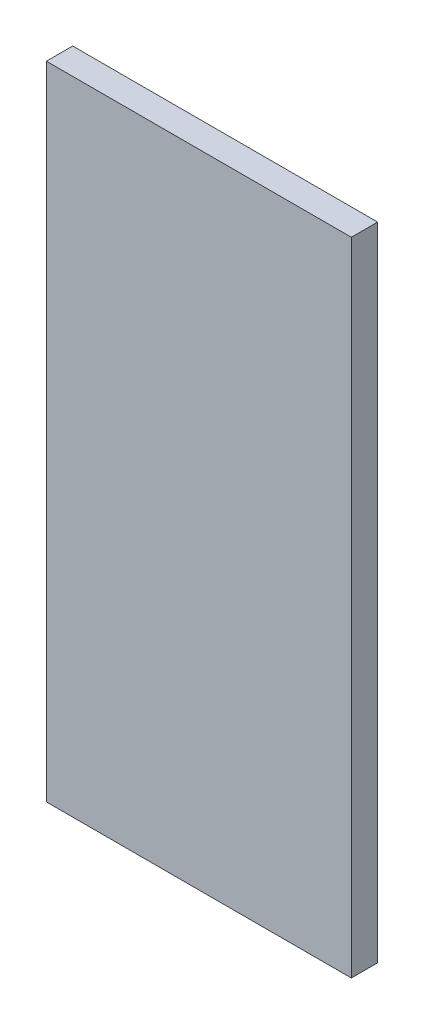
ISO-10303-21;
HEADER;
FILE_DESCRIPTION(('STEP AP214'),'2;1');
FILE_NAME('part.step','',(''),(''),'','','');
FILE_SCHEMA(('AUTOMOTIVE_DESIGN { 1 0 10303 214 1 1 1 1 }'));
ENDSEC;
DATA;
#1=APPLICATION_CONTEXT('core data for automotive mechanical design processes');
#2=APPLICATION_PROTOCOL_DEFINITION('international standard','automotive_design',2000,#1);
#3=PRODUCT_CONTEXT('',#1,'mechanical');
#4=PRODUCT('Part','Part','',(#3));
#5=PRODUCT_RELATED_PRODUCT_CATEGORY('part','',(#4));
#6=PRODUCT_DEFINITION_FORMATION('','',#4);
#7=PRODUCT_DEFINITION_CONTEXT('part definition',#1,'design');
#8=PRODUCT_DEFINITION('design','',#6,#7);
#9=PRODUCT_DEFINITION_SHAPE('','',#8);
#10=(LENGTH_UNIT() NAMED_UNIT(*) SI_UNIT(.MILLI.,.METRE.));
#11=(NAMED_UNIT(*) PLANE_ANGLE_UNIT() SI_UNIT($,.RADIAN.));
#12=(NAMED_UNIT(*) SI_UNIT($,.STERADIAN.) SOLID_ANGLE_UNIT());
#13=UNCERTAINTY_MEASURE_WITH_UNIT(LENGTH_MEASURE(1.E-05),#10,'distance_accuracy_value','');
#14=(GEOMETRIC_REPRESENTATION_CONTEXT(3) GLOBAL_UNCERTAINTY_ASSIGNED_CONTEXT((#13)) GLOBAL_UNIT_ASSIGNED_CONTEXT((#10,
#11,#12)) REPRESENTATION_CONTEXT('',''));
#15=CARTESIAN_POINT('',(0.,0.,0.));
#16=DIRECTION('',(0.,0.,1.));
#17=DIRECTION('',(1.,0.,0.));
#18=AXIS2_PLACEMENT_3D('',#15,#16,#17);
#19=CARTESIAN_POINT('',(145.,-305.,25.));
#20=DIRECTION('',(-1.,0.,0.));
#21=DIRECTION('',(0.,0.,1.));
#22=AXIS2_PLACEMENT_3D('',#19,#20,#21);
#23=PLANE('',#22);
#24=DIRECTION('',(0.,1.,0.));
#25=VECTOR('',#24,1.);
#26=CARTESIAN_POINT('',(145.,-305.,0.));
#27=LINE('',#26,#25);
#28=CARTESIAN_POINT('',(145.,-305.,0.));
#29=VERTEX_POINT('',#28);
#30=CARTESIAN_POINT('',(145.,305.,0.));
#31=VERTEX_POINT('',#30);
#32=EDGE_CURVE('E99',#29,#31,#27,.T.);
#33=ORIENTED_EDGE('',*,*,#32,.T.);
#34=DIRECTION('',(0.,0.,-1.));
#35=VECTOR('',#34,1.);
#36=CARTESIAN_POINT('',(145.,305.,25.));
#37=LINE('',#36,#35);
#38=CARTESIAN_POINT('',(145.,305.,25.));
#39=VERTEX_POINT('',#38);
#40=EDGE_CURVE('E11',#39,#31,#37,.T.);
#41=ORIENTED_EDGE('',*,*,#40,.F.);
#42=DIRECTION('',(0.,1.,0.));
#43=VECTOR('',#42,1.);
#44=CARTESIAN_POINT('',(145.,-305.,25.));
#45=LINE('',#44,#43);
#46=CARTESIAN_POINT('',(145.,-305.,25.));
#47=VERTEX_POINT('',#46);
#48=EDGE_CURVE('E87',#47,#39,#45,.T.);
#49=ORIENTED_EDGE('',*,*,#48,.F.);
#50=DIRECTION('',(0.,0.,-1.));
#51=VECTOR('',#50,1.);
#52=CARTESIAN_POINT('',(145.,-305.,25.));
#53=LINE('',#52,#51);
#54=EDGE_CURVE('E95',#47,#29,#53,.T.);
#55=ORIENTED_EDGE('',*,*,#54,.T.);
#56=EDGE_LOOP('',(#33,#41,#49,#55));
#57=FACE_BOUND('',#56,.T.);
#58=ADVANCED_FACE('F36',(#57),#23,.F.);
#59=CARTESIAN_POINT('',(-145.,305.,25.));
#60=DIRECTION('',(0.,-1.,0.));
#61=DIRECTION('',(0.,0.,-1.));
#62=AXIS2_PLACEMENT_3D('',#59,#60,#61);
#63=PLANE('',#62);
#64=DIRECTION('',(-1.,0.,0.));
#65=VECTOR('',#64,1.);
#66=CARTESIAN_POINT('',(-145.,305.,0.));
#67=LINE('',#66,#65);
#68=CARTESIAN_POINT('',(-145.,305.,0.));
#69=VERTEX_POINT('',#68);
#70=EDGE_CURVE('E91',#31,#69,#67,.T.);
#71=ORIENTED_EDGE('',*,*,#70,.T.);
#72=DIRECTION('',(0.,0.,-1.));
#73=VECTOR('',#72,1.);
#74=CARTESIAN_POINT('',(-145.,305.,25.));
#75=LINE('',#74,#73);
#76=CARTESIAN_POINT('',(-145.,305.,25.));
#77=VERTEX_POINT('',#76);
#78=EDGE_CURVE('E44',#77,#69,#75,.T.);
#79=ORIENTED_EDGE('',*,*,#78,.F.);
#80=DIRECTION('',(-1.,0.,0.));
#81=VECTOR('',#80,1.);
#82=CARTESIAN_POINT('',(-145.,305.,25.));
#83=LINE('',#82,#81);
#84=EDGE_CURVE('E82',#39,#77,#83,.T.);
#85=ORIENTED_EDGE('',*,*,#84,.F.);
#86=ORIENTED_EDGE('',*,*,#40,.T.);
#87=EDGE_LOOP('',(#71,#79,#85,#86));
#88=FACE_BOUND('',#87,.T.);
#89=ADVANCED_FACE('F90',(#88),#63,.F.);
#90=CARTESIAN_POINT('',(-145.,-305.,25.));
#91=DIRECTION('',(1.,0.,0.));
#92=DIRECTION('',(0.,0.,-1.));
#93=AXIS2_PLACEMENT_3D('',#90,#91,#92);
#94=PLANE('',#93);
#95=DIRECTION('',(0.,-1.,0.));
#96=VECTOR('',#95,1.);
#97=CARTESIAN_POINT('',(-145.,-305.,0.));
#98=LINE('',#97,#96);
#99=CARTESIAN_POINT('',(-145.,-305.,0.));
#100=VERTEX_POINT('',#99);
#101=EDGE_CURVE('E69',#69,#100,#98,.T.);
#102=ORIENTED_EDGE('',*,*,#101,.T.);
#103=DIRECTION('',(0.,0.,-1.));
#104=VECTOR('',#103,1.);
#105=CARTESIAN_POINT('',(-145.,-305.,25.));
#106=LINE('',#105,#104);
#107=CARTESIAN_POINT('',(-145.,-305.,25.));
#108=VERTEX_POINT('',#107);
#109=EDGE_CURVE('E92',#108,#100,#106,.T.);
#110=ORIENTED_EDGE('',*,*,#109,.F.);
#111=DIRECTION('',(0.,-1.,0.));
#112=VECTOR('',#111,1.);
#113=CARTESIAN_POINT('',(-145.,-305.,25.));
#114=LINE('',#113,#112);
#115=EDGE_CURVE('E85',#77,#108,#114,.T.);
#116=ORIENTED_EDGE('',*,*,#115,.F.);
#117=ORIENTED_EDGE('',*,*,#78,.T.);
#118=EDGE_LOOP('',(#102,#110,#116,#117));
#119=FACE_BOUND('',#118,.T.);
#120=ADVANCED_FACE('F93',(#119),#94,.F.);
#121=CARTESIAN_POINT('',(-145.,-305.,25.));
#122=DIRECTION('',(0.,1.,0.));
#123=DIRECTION('',(0.,0.,1.));
#124=AXIS2_PLACEMENT_3D('',#121,#122,#123);
#125=PLANE('',#124);
#126=DIRECTION('',(1.,0.,0.));
#127=VECTOR('',#126,1.);
#128=CARTESIAN_POINT('',(-145.,-305.,0.));
#129=LINE('',#128,#127);
#130=EDGE_CURVE('E75',#100,#29,#129,.T.);
#131=ORIENTED_EDGE('',*,*,#130,.T.);
#132=ORIENTED_EDGE('',*,*,#54,.F.);
#133=DIRECTION('',(1.,0.,0.));
#134=VECTOR('',#133,1.);
#135=CARTESIAN_POINT('',(-145.,-305.,25.));
#136=LINE('',#135,#134);
#137=EDGE_CURVE('E52',#108,#47,#136,.T.);
#138=ORIENTED_EDGE('',*,*,#137,.F.);
#139=ORIENTED_EDGE('',*,*,#109,.T.);
#140=EDGE_LOOP('',(#131,#132,#138,#139));
#141=FACE_BOUND('',#140,.T.);
#142=ADVANCED_FACE('F106',(#141),#125,.F.);
#143=CARTESIAN_POINT('',(0.,0.,25.));
#144=DIRECTION('',(0.,0.,-1.));
#145=DIRECTION('',(-1.,0.,0.));
#146=AXIS2_PLACEMENT_3D('',#143,#144,#145);
#147=PLANE('',#146);
#148=ORIENTED_EDGE('',*,*,#48,.T.);
#149=ORIENTED_EDGE('',*,*,#84,.T.);
#150=ORIENTED_EDGE('',*,*,#115,.T.);
#151=ORIENTED_EDGE('',*,*,#137,.T.);
#152=EDGE_LOOP('',(#148,#149,#150,#151));
#153=FACE_BOUND('',#152,.T.);
#154=ADVANCED_FACE('F83',(#153),#147,.F.);
#155=CARTESIAN_POINT('',(0.,0.,0.));
#156=DIRECTION('',(0.,0.,-1.));
#157=DIRECTION('',(-1.,0.,0.));
#158=AXIS2_PLACEMENT_3D('',#155,#156,#157);
#159=PLANE('',#158);
#160=ORIENTED_EDGE('',*,*,#32,.F.);
#161=ORIENTED_EDGE('',*,*,#130,.F.);
#162=ORIENTED_EDGE('',*,*,#101,.F.);
#163=ORIENTED_EDGE('',*,*,#70,.F.);
#164=EDGE_LOOP('',(#160,#161,#162,#163));
#165=FACE_BOUND('',#164,.T.);
#166=ADVANCED_FACE('F109',(#165),#159,.T.);
#167=CLOSED_SHELL('',(#58,#89,#120,#142,#154,#166));
#168=MANIFOLD_SOLID_BREP('B2',#167);
#169=ADVANCED_BREP_SHAPE_REPRESENTATION('',(#18,#168),#14);
#170=SHAPE_DEFINITION_REPRESENTATION(#9,#169);
ENDSEC;
END-ISO-10303-21;
